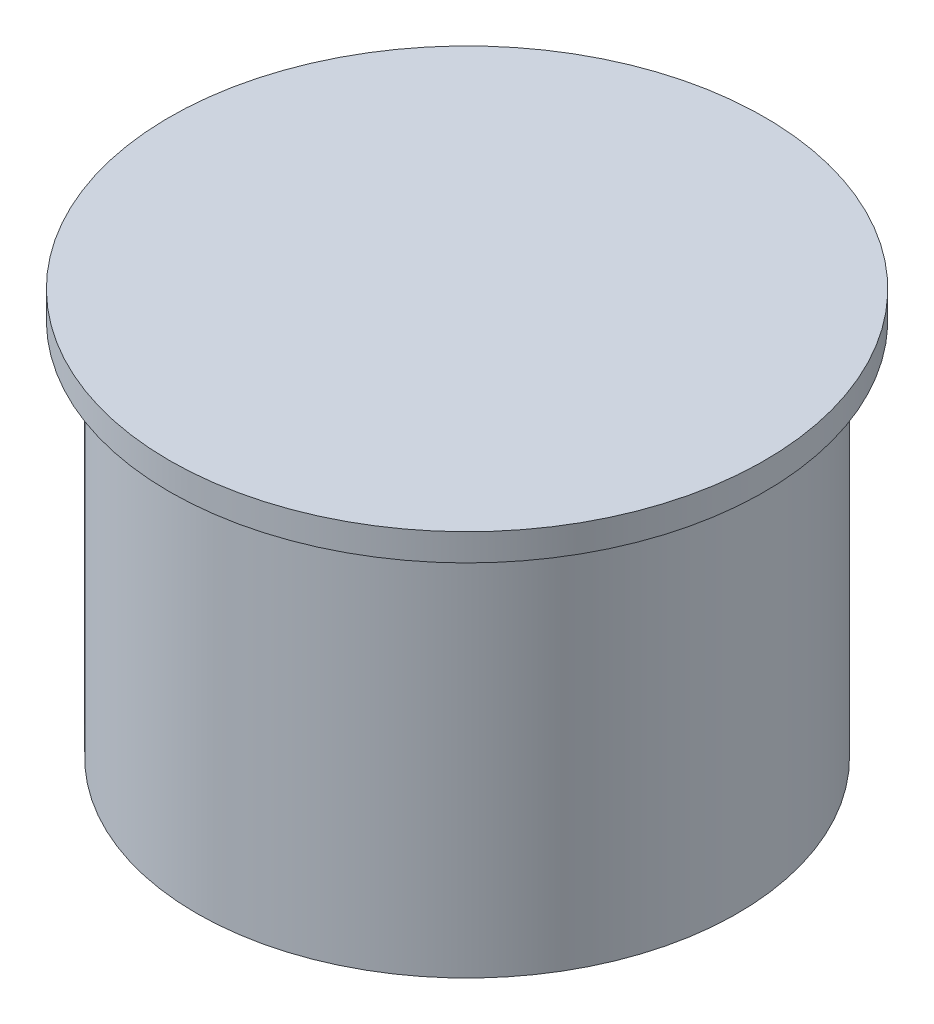
ISO-10303-21;
HEADER;
FILE_DESCRIPTION(('STEP AP214'),'2;1');
FILE_NAME('part.step','',(''),(''),'','','');
FILE_SCHEMA(('AUTOMOTIVE_DESIGN { 1 0 10303 214 1 1 1 1 }'));
ENDSEC;
DATA;
#1=APPLICATION_CONTEXT('core data for automotive mechanical design processes');
#2=APPLICATION_PROTOCOL_DEFINITION('international standard','automotive_design',2000,#1);
#3=PRODUCT_CONTEXT('',#1,'mechanical');
#4=PRODUCT('Part','Part','',(#3));
#5=PRODUCT_RELATED_PRODUCT_CATEGORY('part','',(#4));
#6=PRODUCT_DEFINITION_FORMATION('','',#4);
#7=PRODUCT_DEFINITION_CONTEXT('part definition',#1,'design');
#8=PRODUCT_DEFINITION('design','',#6,#7);
#9=PRODUCT_DEFINITION_SHAPE('','',#8);
#10=(LENGTH_UNIT() NAMED_UNIT(*) SI_UNIT(.MILLI.,.METRE.));
#11=(NAMED_UNIT(*) PLANE_ANGLE_UNIT() SI_UNIT($,.RADIAN.));
#12=(NAMED_UNIT(*) SI_UNIT($,.STERADIAN.) SOLID_ANGLE_UNIT());
#13=UNCERTAINTY_MEASURE_WITH_UNIT(LENGTH_MEASURE(1.E-05),#10,'distance_accuracy_value','');
#14=(GEOMETRIC_REPRESENTATION_CONTEXT(3) GLOBAL_UNCERTAINTY_ASSIGNED_CONTEXT((#13)) GLOBAL_UNIT_ASSIGNED_CONTEXT((#10,
#11,#12)) REPRESENTATION_CONTEXT('',''));
#15=CARTESIAN_POINT('',(0.,0.,0.));
#16=DIRECTION('',(0.,0.,1.));
#17=DIRECTION('',(1.,0.,0.));
#18=AXIS2_PLACEMENT_3D('',#15,#16,#17);
#19=CARTESIAN_POINT('',(0.,0.,0.));
#20=DIRECTION('',(0.,1.,0.));
#21=DIRECTION('',(0.,0.,1.));
#22=AXIS2_PLACEMENT_3D('',#19,#20,#21);
#23=PLANE('',#22);
#24=CARTESIAN_POINT('',(-24.7487373415292,0.,-24.7487373415292));
#25=DIRECTION('',(0.,-1.,0.));
#26=DIRECTION('',(0.,0.,-1.));
#27=AXIS2_PLACEMENT_3D('',#24,#25,#26);
#28=CIRCLE('',#27,4.);
#29=CARTESIAN_POINT('',(-24.7487373415292,0.,-28.7487373415292));
#30=VERTEX_POINT('',#29);
#31=EDGE_CURVE('E58',#30,#30,#28,.T.);
#32=ORIENTED_EDGE('',*,*,#31,.F.);
#33=EDGE_LOOP('',(#32));
#34=FACE_BOUND('',#33,.T.);
#35=CARTESIAN_POINT('',(24.7487373415292,0.,-24.7487373415292));
#36=DIRECTION('',(0.,-1.,0.));
#37=DIRECTION('',(0.,0.,-1.));
#38=AXIS2_PLACEMENT_3D('',#35,#36,#37);
#39=CIRCLE('',#38,4.);
#40=CARTESIAN_POINT('',(24.7487373415292,0.,-28.7487373415292));
#41=VERTEX_POINT('',#40);
#42=EDGE_CURVE('E64',#41,#41,#39,.T.);
#43=ORIENTED_EDGE('',*,*,#42,.F.);
#44=EDGE_LOOP('',(#43));
#45=FACE_BOUND('',#44,.T.);
#46=CARTESIAN_POINT('',(24.7487373415292,0.,24.7487373415292));
#47=DIRECTION('',(0.,-1.,0.));
#48=DIRECTION('',(0.,0.,-1.));
#49=AXIS2_PLACEMENT_3D('',#46,#47,#48);
#50=CIRCLE('',#49,4.);
#51=CARTESIAN_POINT('',(24.7487373415292,0.,20.7487373415292));
#52=VERTEX_POINT('',#51);
#53=EDGE_CURVE('E70',#52,#52,#50,.T.);
#54=ORIENTED_EDGE('',*,*,#53,.F.);
#55=EDGE_LOOP('',(#54));
#56=FACE_BOUND('',#55,.T.);
#57=CARTESIAN_POINT('',(-24.7487373415292,0.,24.7487373415292));
#58=DIRECTION('',(0.,-1.,0.));
#59=DIRECTION('',(0.,0.,-1.));
#60=AXIS2_PLACEMENT_3D('',#57,#58,#59);
#61=CIRCLE('',#60,4.);
#62=CARTESIAN_POINT('',(-24.7487373415292,0.,20.7487373415292));
#63=VERTEX_POINT('',#62);
#64=EDGE_CURVE('E52',#63,#63,#61,.T.);
#65=ORIENTED_EDGE('',*,*,#64,.F.);
#66=EDGE_LOOP('',(#65));
#67=FACE_BOUND('',#66,.T.);
#68=CARTESIAN_POINT('',(0.,0.,0.));
#69=DIRECTION('',(0.,1.,0.));
#70=DIRECTION('',(0.,0.,1.));
#71=AXIS2_PLACEMENT_3D('',#68,#69,#70);
#72=CIRCLE('',#71,50.);
#73=CARTESIAN_POINT('',(0.,0.,50.));
#74=VERTEX_POINT('',#73);
#75=EDGE_CURVE('E10',#74,#74,#72,.T.);
#76=ORIENTED_EDGE('',*,*,#75,.F.);
#77=EDGE_LOOP('',(#76));
#78=FACE_BOUND('',#77,.T.);
#79=ADVANCED_FACE('F32',(#34,#45,#56,#67,#78),#23,.F.);
#80=CARTESIAN_POINT('',(0.,75.,0.));
#81=DIRECTION('',(0.,1.,0.));
#82=DIRECTION('',(0.,0.,1.));
#83=AXIS2_PLACEMENT_3D('',#80,#81,#82);
#84=CYLINDRICAL_SURFACE('',#83,50.);
#85=CARTESIAN_POINT('',(0.,70.,0.));
#86=DIRECTION('',(0.,1.,0.));
#87=DIRECTION('',(0.,0.,1.));
#88=AXIS2_PLACEMENT_3D('',#85,#86,#87);
#89=CIRCLE('',#88,50.);
#90=CARTESIAN_POINT('',(0.,70.,50.));
#91=VERTEX_POINT('',#90);
#92=EDGE_CURVE('E38',#91,#91,#89,.T.);
#93=ORIENTED_EDGE('',*,*,#92,.F.);
#94=EDGE_LOOP('',(#93));
#95=FACE_BOUND('',#94,.T.);
#96=ORIENTED_EDGE('',*,*,#75,.T.);
#97=EDGE_LOOP('',(#96));
#98=FACE_BOUND('',#97,.T.);
#99=ADVANCED_FACE('F87',(#95,#98),#84,.T.);
#100=CARTESIAN_POINT('',(0.,70.,-50.));
#101=DIRECTION('',(0.,1.,0.));
#102=DIRECTION('',(0.,0.,1.));
#103=AXIS2_PLACEMENT_3D('',#100,#101,#102);
#104=PLANE('',#103);
#105=CARTESIAN_POINT('',(0.,70.,0.));
#106=DIRECTION('',(0.,1.,0.));
#107=DIRECTION('',(0.,0.,1.));
#108=AXIS2_PLACEMENT_3D('',#105,#106,#107);
#109=CIRCLE('',#108,55.);
#110=CARTESIAN_POINT('',(0.,70.,55.));
#111=VERTEX_POINT('',#110);
#112=EDGE_CURVE('E42',#111,#111,#109,.T.);
#113=ORIENTED_EDGE('',*,*,#112,.F.);
#114=EDGE_LOOP('',(#113));
#115=FACE_BOUND('',#114,.T.);
#116=ORIENTED_EDGE('',*,*,#92,.T.);
#117=EDGE_LOOP('',(#116));
#118=FACE_BOUND('',#117,.T.);
#119=ADVANCED_FACE('F111',(#115,#118),#104,.F.);
#120=CARTESIAN_POINT('',(0.,75.,0.));
#121=DIRECTION('',(0.,1.,0.));
#122=DIRECTION('',(0.,0.,1.));
#123=AXIS2_PLACEMENT_3D('',#120,#121,#122);
#124=CYLINDRICAL_SURFACE('',#123,55.);
#125=CARTESIAN_POINT('',(0.,75.,0.));
#126=DIRECTION('',(0.,1.,0.));
#127=DIRECTION('',(0.,0.,1.));
#128=AXIS2_PLACEMENT_3D('',#125,#126,#127);
#129=CIRCLE('',#128,55.);
#130=CARTESIAN_POINT('',(0.,75.,55.));
#131=VERTEX_POINT('',#130);
#132=EDGE_CURVE('E46',#131,#131,#129,.T.);
#133=ORIENTED_EDGE('',*,*,#132,.F.);
#134=EDGE_LOOP('',(#133));
#135=FACE_BOUND('',#134,.T.);
#136=ORIENTED_EDGE('',*,*,#112,.T.);
#137=EDGE_LOOP('',(#136));
#138=FACE_BOUND('',#137,.T.);
#139=ADVANCED_FACE('F103',(#135,#138),#124,.T.);
#140=CARTESIAN_POINT('',(0.,75.,-55.));
#141=DIRECTION('',(0.,-1.,0.));
#142=DIRECTION('',(0.,0.,-1.));
#143=AXIS2_PLACEMENT_3D('',#140,#141,#142);
#144=PLANE('',#143);
#145=ORIENTED_EDGE('',*,*,#132,.T.);
#146=EDGE_LOOP('',(#145));
#147=FACE_BOUND('',#146,.T.);
#148=ADVANCED_FACE('F94',(#147),#144,.F.);
#149=CARTESIAN_POINT('',(-24.7487373415292,30.,24.7487373415292));
#150=DIRECTION('',(0.,-1.,0.));
#151=DIRECTION('',(0.,0.,-1.));
#152=AXIS2_PLACEMENT_3D('',#149,#150,#151);
#153=CYLINDRICAL_SURFACE('',#152,4.);
#154=CARTESIAN_POINT('',(-24.7487373415292,30.,24.7487373415292));
#155=DIRECTION('',(0.,-1.,0.));
#156=DIRECTION('',(0.,0.,-1.));
#157=AXIS2_PLACEMENT_3D('',#154,#155,#156);
#158=CIRCLE('',#157,4.);
#159=CARTESIAN_POINT('',(-24.7487373415292,30.,20.7487373415292));
#160=VERTEX_POINT('',#159);
#161=EDGE_CURVE('E51',#160,#160,#158,.T.);
#162=ORIENTED_EDGE('',*,*,#161,.F.);
#163=EDGE_LOOP('',(#162));
#164=FACE_BOUND('',#163,.T.);
#165=ORIENTED_EDGE('',*,*,#64,.T.);
#166=EDGE_LOOP('',(#165));
#167=FACE_BOUND('',#166,.T.);
#168=ADVANCED_FACE('F92',(#164,#167),#153,.F.);
#169=CARTESIAN_POINT('',(-24.7487373415292,30.,24.7487373415292));
#170=DIRECTION('',(0.,-1.,0.));
#171=DIRECTION('',(0.,0.,-1.));
#172=AXIS2_PLACEMENT_3D('',#169,#170,#171);
#173=PLANE('',#172);
#174=ORIENTED_EDGE('',*,*,#161,.T.);
#175=EDGE_LOOP('',(#174));
#176=FACE_BOUND('',#175,.T.);
#177=ADVANCED_FACE('F81',(#176),#173,.T.);
#178=CARTESIAN_POINT('',(24.7487373415292,30.,24.7487373415292));
#179=DIRECTION('',(0.,-1.,0.));
#180=DIRECTION('',(0.,0.,-1.));
#181=AXIS2_PLACEMENT_3D('',#178,#179,#180);
#182=CYLINDRICAL_SURFACE('',#181,4.);
#183=CARTESIAN_POINT('',(24.7487373415292,30.,24.7487373415292));
#184=DIRECTION('',(0.,-1.,0.));
#185=DIRECTION('',(0.,0.,-1.));
#186=AXIS2_PLACEMENT_3D('',#183,#184,#185);
#187=CIRCLE('',#186,4.);
#188=CARTESIAN_POINT('',(24.7487373415292,30.,20.7487373415292));
#189=VERTEX_POINT('',#188);
#190=EDGE_CURVE('E55',#189,#189,#187,.T.);
#191=ORIENTED_EDGE('',*,*,#190,.F.);
#192=EDGE_LOOP('',(#191));
#193=FACE_BOUND('',#192,.T.);
#194=ORIENTED_EDGE('',*,*,#53,.T.);
#195=EDGE_LOOP('',(#194));
#196=FACE_BOUND('',#195,.T.);
#197=ADVANCED_FACE('F78',(#193,#196),#182,.F.);
#198=CARTESIAN_POINT('',(24.7487373415292,30.,24.7487373415292));
#199=DIRECTION('',(0.,-1.,0.));
#200=DIRECTION('',(0.,0.,-1.));
#201=AXIS2_PLACEMENT_3D('',#198,#199,#200);
#202=PLANE('',#201);
#203=ORIENTED_EDGE('',*,*,#190,.T.);
#204=EDGE_LOOP('',(#203));
#205=FACE_BOUND('',#204,.T.);
#206=ADVANCED_FACE('F76',(#205),#202,.T.);
#207=CARTESIAN_POINT('',(24.7487373415292,30.,-24.7487373415292));
#208=DIRECTION('',(0.,-1.,0.));
#209=DIRECTION('',(0.,0.,-1.));
#210=AXIS2_PLACEMENT_3D('',#207,#208,#209);
#211=CYLINDRICAL_SURFACE('',#210,4.);
#212=CARTESIAN_POINT('',(24.7487373415292,30.,-24.7487373415292));
#213=DIRECTION('',(0.,-1.,0.));
#214=DIRECTION('',(0.,0.,-1.));
#215=AXIS2_PLACEMENT_3D('',#212,#213,#214);
#216=CIRCLE('',#215,4.);
#217=CARTESIAN_POINT('',(24.7487373415292,30.,-28.7487373415292));
#218=VERTEX_POINT('',#217);
#219=EDGE_CURVE('E67',#218,#218,#216,.T.);
#220=ORIENTED_EDGE('',*,*,#219,.F.);
#221=EDGE_LOOP('',(#220));
#222=FACE_BOUND('',#221,.T.);
#223=ORIENTED_EDGE('',*,*,#42,.T.);
#224=EDGE_LOOP('',(#223));
#225=FACE_BOUND('',#224,.T.);
#226=ADVANCED_FACE('F162',(#222,#225),#211,.F.);
#227=CARTESIAN_POINT('',(24.7487373415292,30.,-24.7487373415292));
#228=DIRECTION('',(0.,-1.,0.));
#229=DIRECTION('',(0.,0.,-1.));
#230=AXIS2_PLACEMENT_3D('',#227,#228,#229);
#231=PLANE('',#230);
#232=ORIENTED_EDGE('',*,*,#219,.T.);
#233=EDGE_LOOP('',(#232));
#234=FACE_BOUND('',#233,.T.);
#235=ADVANCED_FACE('F171',(#234),#231,.T.);
#236=CARTESIAN_POINT('',(-24.7487373415292,30.,-24.7487373415292));
#237=DIRECTION('',(0.,-1.,0.));
#238=DIRECTION('',(0.,0.,-1.));
#239=AXIS2_PLACEMENT_3D('',#236,#237,#238);
#240=CYLINDRICAL_SURFACE('',#239,4.);
#241=CARTESIAN_POINT('',(-24.7487373415292,30.,-24.7487373415292));
#242=DIRECTION('',(0.,-1.,0.));
#243=DIRECTION('',(0.,0.,-1.));
#244=AXIS2_PLACEMENT_3D('',#241,#242,#243);
#245=CIRCLE('',#244,4.);
#246=CARTESIAN_POINT('',(-24.7487373415292,30.,-28.7487373415292));
#247=VERTEX_POINT('',#246);
#248=EDGE_CURVE('E61',#247,#247,#245,.T.);
#249=ORIENTED_EDGE('',*,*,#248,.F.);
#250=EDGE_LOOP('',(#249));
#251=FACE_BOUND('',#250,.T.);
#252=ORIENTED_EDGE('',*,*,#31,.T.);
#253=EDGE_LOOP('',(#252));
#254=FACE_BOUND('',#253,.T.);
#255=ADVANCED_FACE('F181',(#251,#254),#240,.F.);
#256=CARTESIAN_POINT('',(-24.7487373415292,30.,-24.7487373415292));
#257=DIRECTION('',(0.,-1.,0.));
#258=DIRECTION('',(0.,0.,-1.));
#259=AXIS2_PLACEMENT_3D('',#256,#257,#258);
#260=PLANE('',#259);
#261=ORIENTED_EDGE('',*,*,#248,.T.);
#262=EDGE_LOOP('',(#261));
#263=FACE_BOUND('',#262,.T.);
#264=ADVANCED_FACE('F191',(#263),#260,.T.);
#265=CLOSED_SHELL('',(#79,#99,#119,#139,#148,#168,#177,#197,#206,#226,#235,#255,#264));
#266=MANIFOLD_SOLID_BREP('B2',#265);
#267=ADVANCED_BREP_SHAPE_REPRESENTATION('',(#18,#266),#14);
#268=SHAPE_DEFINITION_REPRESENTATION(#9,#267);
ENDSEC;
END-ISO-10303-21;
